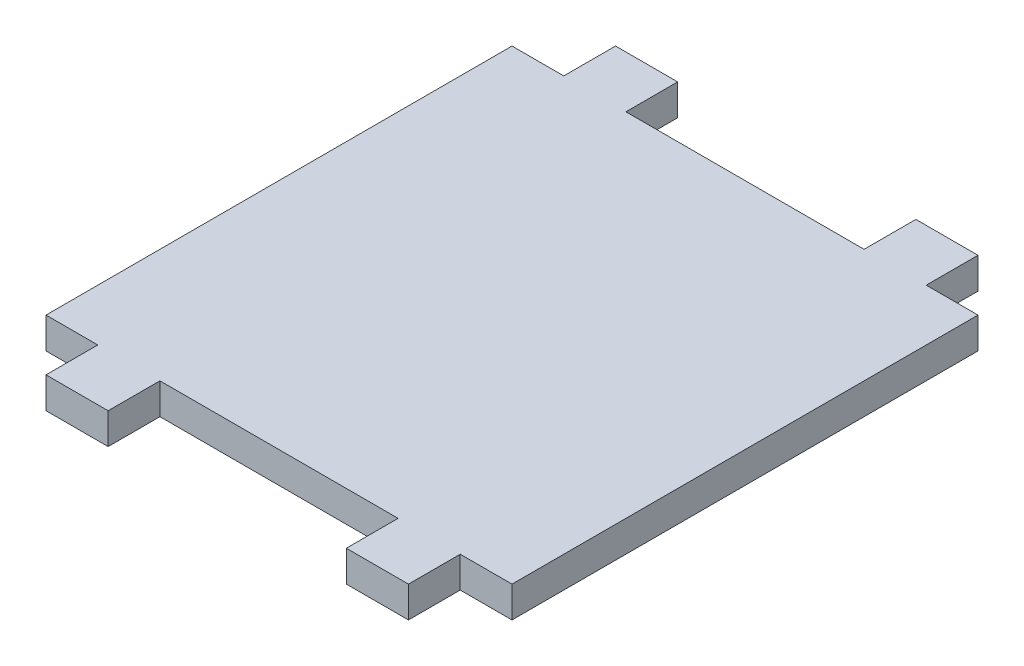
ISO-10303-21;
HEADER;
FILE_DESCRIPTION(('STEP AP214'),'2;1');
FILE_NAME('part.step','',(''),(''),'','','');
FILE_SCHEMA(('AUTOMOTIVE_DESIGN { 1 0 10303 214 1 1 1 1 }'));
ENDSEC;
DATA;
#1=APPLICATION_CONTEXT('core data for automotive mechanical design processes');
#2=APPLICATION_PROTOCOL_DEFINITION('international standard','automotive_design',2000,#1);
#3=PRODUCT_CONTEXT('',#1,'mechanical');
#4=PRODUCT('Part','Part','',(#3));
#5=PRODUCT_RELATED_PRODUCT_CATEGORY('part','',(#4));
#6=PRODUCT_DEFINITION_FORMATION('','',#4);
#7=PRODUCT_DEFINITION_CONTEXT('part definition',#1,'design');
#8=PRODUCT_DEFINITION('design','',#6,#7);
#9=PRODUCT_DEFINITION_SHAPE('','',#8);
#10=(LENGTH_UNIT() NAMED_UNIT(*) SI_UNIT(.MILLI.,.METRE.));
#11=(NAMED_UNIT(*) PLANE_ANGLE_UNIT() SI_UNIT($,.RADIAN.));
#12=(NAMED_UNIT(*) SI_UNIT($,.STERADIAN.) SOLID_ANGLE_UNIT());
#13=UNCERTAINTY_MEASURE_WITH_UNIT(LENGTH_MEASURE(1.E-05),#10,'distance_accuracy_value','');
#14=(GEOMETRIC_REPRESENTATION_CONTEXT(3) GLOBAL_UNCERTAINTY_ASSIGNED_CONTEXT((#13)) GLOBAL_UNIT_ASSIGNED_CONTEXT((#10,
#11,#12)) REPRESENTATION_CONTEXT('',''));
#15=CARTESIAN_POINT('',(0.,0.,0.));
#16=DIRECTION('',(0.,0.,1.));
#17=DIRECTION('',(1.,0.,0.));
#18=AXIS2_PLACEMENT_3D('',#15,#16,#17);
#19=CARTESIAN_POINT('',(22.5,3.,0.));
#20=DIRECTION('',(1.,0.,0.));
#21=DIRECTION('',(0.,0.,-1.));
#22=AXIS2_PLACEMENT_3D('',#19,#20,#21);
#23=PLANE('',#22);
#24=DIRECTION('',(0.,0.,1.));
#25=VECTOR('',#24,1.);
#26=CARTESIAN_POINT('',(22.5,0.,0.));
#27=LINE('',#26,#25);
#28=CARTESIAN_POINT('',(22.5,0.,-22.5));
#29=VERTEX_POINT('',#28);
#30=CARTESIAN_POINT('',(22.5,0.,22.5));
#31=VERTEX_POINT('',#30);
#32=EDGE_CURVE('E204',#29,#31,#27,.T.);
#33=ORIENTED_EDGE('',*,*,#32,.F.);
#34=DIRECTION('',(0.,-1.,0.));
#35=VECTOR('',#34,1.);
#36=CARTESIAN_POINT('',(22.5,3.,-22.5));
#37=LINE('',#36,#35);
#38=CARTESIAN_POINT('',(22.5,3.,-22.5));
#39=VERTEX_POINT('',#38);
#40=EDGE_CURVE('E11',#39,#29,#37,.T.);
#41=ORIENTED_EDGE('',*,*,#40,.F.);
#42=DIRECTION('',(0.,0.,1.));
#43=VECTOR('',#42,1.);
#44=CARTESIAN_POINT('',(22.5,3.,0.));
#45=LINE('',#44,#43);
#46=CARTESIAN_POINT('',(22.5,3.,22.5));
#47=VERTEX_POINT('',#46);
#48=EDGE_CURVE('E298',#39,#47,#45,.T.);
#49=ORIENTED_EDGE('',*,*,#48,.T.);
#50=DIRECTION('',(0.,-1.,0.));
#51=VECTOR('',#50,1.);
#52=CARTESIAN_POINT('',(22.5,3.,22.5));
#53=LINE('',#52,#51);
#54=EDGE_CURVE('E123',#47,#31,#53,.T.);
#55=ORIENTED_EDGE('',*,*,#54,.T.);
#56=EDGE_LOOP('',(#33,#41,#49,#55));
#57=FACE_BOUND('',#56,.T.);
#58=ADVANCED_FACE('F37',(#57),#23,.T.);
#59=CARTESIAN_POINT('',(0.,3.,-22.5));
#60=DIRECTION('',(0.,0.,-1.));
#61=DIRECTION('',(-1.,0.,0.));
#62=AXIS2_PLACEMENT_3D('',#59,#60,#61);
#63=PLANE('',#62);
#64=DIRECTION('',(1.,0.,0.));
#65=VECTOR('',#64,1.);
#66=CARTESIAN_POINT('',(0.,0.,-22.5));
#67=LINE('',#66,#65);
#68=CARTESIAN_POINT('',(17.5,0.,-22.5));
#69=VERTEX_POINT('',#68);
#70=EDGE_CURVE('E207',#69,#29,#67,.T.);
#71=ORIENTED_EDGE('',*,*,#70,.F.);
#72=DIRECTION('',(0.,-1.,0.));
#73=VECTOR('',#72,1.);
#74=CARTESIAN_POINT('',(17.5,3.,-22.5));
#75=LINE('',#74,#73);
#76=CARTESIAN_POINT('',(17.5,3.,-22.5));
#77=VERTEX_POINT('',#76);
#78=EDGE_CURVE('E45',#77,#69,#75,.T.);
#79=ORIENTED_EDGE('',*,*,#78,.F.);
#80=DIRECTION('',(1.,0.,0.));
#81=VECTOR('',#80,1.);
#82=CARTESIAN_POINT('',(0.,3.,-22.5));
#83=LINE('',#82,#81);
#84=EDGE_CURVE('E297',#77,#39,#83,.T.);
#85=ORIENTED_EDGE('',*,*,#84,.T.);
#86=ORIENTED_EDGE('',*,*,#40,.T.);
#87=EDGE_LOOP('',(#71,#79,#85,#86));
#88=FACE_BOUND('',#87,.T.);
#89=ADVANCED_FACE('F296',(#88),#63,.T.);
#90=CARTESIAN_POINT('',(17.5,3.,0.));
#91=DIRECTION('',(-1.,0.,0.));
#92=DIRECTION('',(0.,0.,1.));
#93=AXIS2_PLACEMENT_3D('',#90,#91,#92);
#94=PLANE('',#93);
#95=DIRECTION('',(0.,0.,-1.));
#96=VECTOR('',#95,1.);
#97=CARTESIAN_POINT('',(17.5,0.,0.));
#98=LINE('',#97,#96);
#99=CARTESIAN_POINT('',(17.5,0.,-27.5));
#100=VERTEX_POINT('',#99);
#101=EDGE_CURVE('E210',#69,#100,#98,.T.);
#102=ORIENTED_EDGE('',*,*,#101,.T.);
#103=DIRECTION('',(0.,-1.,0.));
#104=VECTOR('',#103,1.);
#105=CARTESIAN_POINT('',(17.5,3.,-27.5));
#106=LINE('',#105,#104);
#107=CARTESIAN_POINT('',(17.5,3.,-27.5));
#108=VERTEX_POINT('',#107);
#109=EDGE_CURVE('E282',#108,#100,#106,.T.);
#110=ORIENTED_EDGE('',*,*,#109,.F.);
#111=DIRECTION('',(0.,0.,-1.));
#112=VECTOR('',#111,1.);
#113=CARTESIAN_POINT('',(17.5,3.,0.));
#114=LINE('',#113,#112);
#115=EDGE_CURVE('E288',#77,#108,#114,.T.);
#116=ORIENTED_EDGE('',*,*,#115,.F.);
#117=ORIENTED_EDGE('',*,*,#78,.T.);
#118=EDGE_LOOP('',(#102,#110,#116,#117));
#119=FACE_BOUND('',#118,.T.);
#120=ADVANCED_FACE('F286',(#119),#94,.F.);
#121=CARTESIAN_POINT('',(0.,3.,-27.5));
#122=DIRECTION('',(0.,0.,-1.));
#123=DIRECTION('',(-1.,0.,0.));
#124=AXIS2_PLACEMENT_3D('',#121,#122,#123);
#125=PLANE('',#124);
#126=DIRECTION('',(1.,0.,0.));
#127=VECTOR('',#126,1.);
#128=CARTESIAN_POINT('',(0.,0.,-27.5));
#129=LINE('',#128,#127);
#130=CARTESIAN_POINT('',(11.5,0.,-27.5));
#131=VERTEX_POINT('',#130);
#132=EDGE_CURVE('E215',#131,#100,#129,.T.);
#133=ORIENTED_EDGE('',*,*,#132,.F.);
#134=DIRECTION('',(0.,-1.,0.));
#135=VECTOR('',#134,1.);
#136=CARTESIAN_POINT('',(11.5,3.,-27.5));
#137=LINE('',#136,#135);
#138=CARTESIAN_POINT('',(11.5,3.,-27.5));
#139=VERTEX_POINT('',#138);
#140=EDGE_CURVE('E280',#139,#131,#137,.T.);
#141=ORIENTED_EDGE('',*,*,#140,.F.);
#142=DIRECTION('',(1.,0.,0.));
#143=VECTOR('',#142,1.);
#144=CARTESIAN_POINT('',(0.,3.,-27.5));
#145=LINE('',#144,#143);
#146=EDGE_CURVE('E332',#139,#108,#145,.T.);
#147=ORIENTED_EDGE('',*,*,#146,.T.);
#148=ORIENTED_EDGE('',*,*,#109,.T.);
#149=EDGE_LOOP('',(#133,#141,#147,#148));
#150=FACE_BOUND('',#149,.T.);
#151=ADVANCED_FACE('F385',(#150),#125,.T.);
#152=CARTESIAN_POINT('',(11.5,3.,0.));
#153=DIRECTION('',(-1.,0.,0.));
#154=DIRECTION('',(0.,0.,1.));
#155=AXIS2_PLACEMENT_3D('',#152,#153,#154);
#156=PLANE('',#155);
#157=DIRECTION('',(0.,0.,-1.));
#158=VECTOR('',#157,1.);
#159=CARTESIAN_POINT('',(11.5,0.,0.));
#160=LINE('',#159,#158);
#161=CARTESIAN_POINT('',(11.5,0.,-22.5));
#162=VERTEX_POINT('',#161);
#163=EDGE_CURVE('E218',#162,#131,#160,.T.);
#164=ORIENTED_EDGE('',*,*,#163,.F.);
#165=DIRECTION('',(0.,-1.,0.));
#166=VECTOR('',#165,1.);
#167=CARTESIAN_POINT('',(11.5,3.,-22.5));
#168=LINE('',#167,#166);
#169=CARTESIAN_POINT('',(11.5,3.,-22.5));
#170=VERTEX_POINT('',#169);
#171=EDGE_CURVE('E278',#170,#162,#168,.T.);
#172=ORIENTED_EDGE('',*,*,#171,.F.);
#173=DIRECTION('',(0.,0.,-1.));
#174=VECTOR('',#173,1.);
#175=CARTESIAN_POINT('',(11.5,3.,0.));
#176=LINE('',#175,#174);
#177=EDGE_CURVE('E329',#170,#139,#176,.T.);
#178=ORIENTED_EDGE('',*,*,#177,.T.);
#179=ORIENTED_EDGE('',*,*,#140,.T.);
#180=EDGE_LOOP('',(#164,#172,#178,#179));
#181=FACE_BOUND('',#180,.T.);
#182=ADVANCED_FACE('F349',(#181),#156,.T.);
#183=CARTESIAN_POINT('',(-11.5,0.,-22.5));
#184=VERTEX_POINT('',#183);
#185=EDGE_CURVE('E212',#184,#162,#67,.T.);
#186=ORIENTED_EDGE('',*,*,#185,.F.);
#187=DIRECTION('',(0.,-1.,0.));
#188=VECTOR('',#187,1.);
#189=CARTESIAN_POINT('',(-11.5,3.,-22.5));
#190=LINE('',#189,#188);
#191=CARTESIAN_POINT('',(-11.5,3.,-22.5));
#192=VERTEX_POINT('',#191);
#193=EDGE_CURVE('E276',#192,#184,#190,.T.);
#194=ORIENTED_EDGE('',*,*,#193,.F.);
#195=EDGE_CURVE('E328',#192,#170,#83,.T.);
#196=ORIENTED_EDGE('',*,*,#195,.T.);
#197=ORIENTED_EDGE('',*,*,#171,.T.);
#198=EDGE_LOOP('',(#186,#194,#196,#197));
#199=FACE_BOUND('',#198,.T.);
#200=ADVANCED_FACE('F341',(#199),#63,.T.);
#201=CARTESIAN_POINT('',(-11.5,3.,0.));
#202=DIRECTION('',(-1.,0.,0.));
#203=DIRECTION('',(0.,0.,1.));
#204=AXIS2_PLACEMENT_3D('',#201,#202,#203);
#205=PLANE('',#204);
#206=DIRECTION('',(0.,0.,-1.));
#207=VECTOR('',#206,1.);
#208=CARTESIAN_POINT('',(-11.5,0.,0.));
#209=LINE('',#208,#207);
#210=CARTESIAN_POINT('',(-11.5,0.,-27.5));
#211=VERTEX_POINT('',#210);
#212=EDGE_CURVE('E221',#184,#211,#209,.T.);
#213=ORIENTED_EDGE('',*,*,#212,.T.);
#214=DIRECTION('',(0.,-1.,0.));
#215=VECTOR('',#214,1.);
#216=CARTESIAN_POINT('',(-11.5,3.,-27.5));
#217=LINE('',#216,#215);
#218=CARTESIAN_POINT('',(-11.5,3.,-27.5));
#219=VERTEX_POINT('',#218);
#220=EDGE_CURVE('E274',#219,#211,#217,.T.);
#221=ORIENTED_EDGE('',*,*,#220,.F.);
#222=DIRECTION('',(0.,0.,-1.));
#223=VECTOR('',#222,1.);
#224=CARTESIAN_POINT('',(-11.5,3.,0.));
#225=LINE('',#224,#223);
#226=EDGE_CURVE('E326',#192,#219,#225,.T.);
#227=ORIENTED_EDGE('',*,*,#226,.F.);
#228=ORIENTED_EDGE('',*,*,#193,.T.);
#229=EDGE_LOOP('',(#213,#221,#227,#228));
#230=FACE_BOUND('',#229,.T.);
#231=ADVANCED_FACE('F368',(#230),#205,.F.);
#232=CARTESIAN_POINT('',(0.,3.,-27.5));
#233=DIRECTION('',(0.,0.,-1.));
#234=DIRECTION('',(-1.,0.,0.));
#235=AXIS2_PLACEMENT_3D('',#232,#233,#234);
#236=PLANE('',#235);
#237=DIRECTION('',(1.,0.,0.));
#238=VECTOR('',#237,1.);
#239=CARTESIAN_POINT('',(0.,0.,-27.5));
#240=LINE('',#239,#238);
#241=CARTESIAN_POINT('',(-17.5,0.,-27.5));
#242=VERTEX_POINT('',#241);
#243=EDGE_CURVE('E224',#242,#211,#240,.T.);
#244=ORIENTED_EDGE('',*,*,#243,.F.);
#245=DIRECTION('',(0.,-1.,0.));
#246=VECTOR('',#245,1.);
#247=CARTESIAN_POINT('',(-17.5,3.,-27.5));
#248=LINE('',#247,#246);
#249=CARTESIAN_POINT('',(-17.5,3.,-27.5));
#250=VERTEX_POINT('',#249);
#251=EDGE_CURVE('E272',#250,#242,#248,.T.);
#252=ORIENTED_EDGE('',*,*,#251,.F.);
#253=DIRECTION('',(1.,0.,0.));
#254=VECTOR('',#253,1.);
#255=CARTESIAN_POINT('',(0.,3.,-27.5));
#256=LINE('',#255,#254);
#257=EDGE_CURVE('E323',#250,#219,#256,.T.);
#258=ORIENTED_EDGE('',*,*,#257,.T.);
#259=ORIENTED_EDGE('',*,*,#220,.T.);
#260=EDGE_LOOP('',(#244,#252,#258,#259));
#261=FACE_BOUND('',#260,.T.);
#262=ADVANCED_FACE('F366',(#261),#236,.T.);
#263=CARTESIAN_POINT('',(-17.5,3.,0.));
#264=DIRECTION('',(-1.,0.,0.));
#265=DIRECTION('',(0.,0.,1.));
#266=AXIS2_PLACEMENT_3D('',#263,#264,#265);
#267=PLANE('',#266);
#268=DIRECTION('',(0.,0.,-1.));
#269=VECTOR('',#268,1.);
#270=CARTESIAN_POINT('',(-17.5,0.,0.));
#271=LINE('',#270,#269);
#272=CARTESIAN_POINT('',(-17.5,0.,-22.5));
#273=VERTEX_POINT('',#272);
#274=EDGE_CURVE('E227',#273,#242,#271,.T.);
#275=ORIENTED_EDGE('',*,*,#274,.F.);
#276=DIRECTION('',(0.,-1.,0.));
#277=VECTOR('',#276,1.);
#278=CARTESIAN_POINT('',(-17.5,3.,-22.5));
#279=LINE('',#278,#277);
#280=CARTESIAN_POINT('',(-17.5,3.,-22.5));
#281=VERTEX_POINT('',#280);
#282=EDGE_CURVE('E270',#281,#273,#279,.T.);
#283=ORIENTED_EDGE('',*,*,#282,.F.);
#284=DIRECTION('',(0.,0.,-1.));
#285=VECTOR('',#284,1.);
#286=CARTESIAN_POINT('',(-17.5,3.,0.));
#287=LINE('',#286,#285);
#288=EDGE_CURVE('E320',#281,#250,#287,.T.);
#289=ORIENTED_EDGE('',*,*,#288,.T.);
#290=ORIENTED_EDGE('',*,*,#251,.T.);
#291=EDGE_LOOP('',(#275,#283,#289,#290));
#292=FACE_BOUND('',#291,.T.);
#293=ADVANCED_FACE('F363',(#292),#267,.T.);
#294=CARTESIAN_POINT('',(-22.5,0.,-22.5));
#295=VERTEX_POINT('',#294);
#296=EDGE_CURVE('E211',#295,#273,#67,.T.);
#297=ORIENTED_EDGE('',*,*,#296,.F.);
#298=DIRECTION('',(0.,-1.,0.));
#299=VECTOR('',#298,1.);
#300=CARTESIAN_POINT('',(-22.5,3.,-22.5));
#301=LINE('',#300,#299);
#302=CARTESIAN_POINT('',(-22.5,3.,-22.5));
#303=VERTEX_POINT('',#302);
#304=EDGE_CURVE('E268',#303,#295,#301,.T.);
#305=ORIENTED_EDGE('',*,*,#304,.F.);
#306=EDGE_CURVE('E319',#303,#281,#83,.T.);
#307=ORIENTED_EDGE('',*,*,#306,.T.);
#308=ORIENTED_EDGE('',*,*,#282,.T.);
#309=EDGE_LOOP('',(#297,#305,#307,#308));
#310=FACE_BOUND('',#309,.T.);
#311=ADVANCED_FACE('F358',(#310),#63,.T.);
#312=CARTESIAN_POINT('',(-22.5,3.,0.));
#313=DIRECTION('',(1.,0.,0.));
#314=DIRECTION('',(0.,0.,-1.));
#315=AXIS2_PLACEMENT_3D('',#312,#313,#314);
#316=PLANE('',#315);
#317=DIRECTION('',(0.,0.,1.));
#318=VECTOR('',#317,1.);
#319=CARTESIAN_POINT('',(-22.5,0.,0.));
#320=LINE('',#319,#318);
#321=CARTESIAN_POINT('',(-22.5,0.,22.5));
#322=VERTEX_POINT('',#321);
#323=EDGE_CURVE('E230',#295,#322,#320,.T.);
#324=ORIENTED_EDGE('',*,*,#323,.T.);
#325=DIRECTION('',(0.,-1.,0.));
#326=VECTOR('',#325,1.);
#327=CARTESIAN_POINT('',(-22.5,3.,22.5));
#328=LINE('',#327,#326);
#329=CARTESIAN_POINT('',(-22.5,3.,22.5));
#330=VERTEX_POINT('',#329);
#331=EDGE_CURVE('E265',#330,#322,#328,.T.);
#332=ORIENTED_EDGE('',*,*,#331,.F.);
#333=DIRECTION('',(0.,0.,1.));
#334=VECTOR('',#333,1.);
#335=CARTESIAN_POINT('',(-22.5,3.,0.));
#336=LINE('',#335,#334);
#337=EDGE_CURVE('E317',#303,#330,#336,.T.);
#338=ORIENTED_EDGE('',*,*,#337,.F.);
#339=ORIENTED_EDGE('',*,*,#304,.T.);
#340=EDGE_LOOP('',(#324,#332,#338,#339));
#341=FACE_BOUND('',#340,.T.);
#342=ADVANCED_FACE('F389',(#341),#316,.F.);
#343=CARTESIAN_POINT('',(0.,3.,22.5));
#344=DIRECTION('',(0.,0.,-1.));
#345=DIRECTION('',(-1.,0.,0.));
#346=AXIS2_PLACEMENT_3D('',#343,#344,#345);
#347=PLANE('',#346);
#348=DIRECTION('',(1.,0.,0.));
#349=VECTOR('',#348,1.);
#350=CARTESIAN_POINT('',(0.,0.,22.5));
#351=LINE('',#350,#349);
#352=CARTESIAN_POINT('',(-17.5,0.,22.5));
#353=VERTEX_POINT('',#352);
#354=EDGE_CURVE('E232',#322,#353,#351,.T.);
#355=ORIENTED_EDGE('',*,*,#354,.T.);
#356=DIRECTION('',(0.,-1.,0.));
#357=VECTOR('',#356,1.);
#358=CARTESIAN_POINT('',(-17.5,3.,22.5));
#359=LINE('',#358,#357);
#360=CARTESIAN_POINT('',(-17.5,3.,22.5));
#361=VERTEX_POINT('',#360);
#362=EDGE_CURVE('E262',#361,#353,#359,.T.);
#363=ORIENTED_EDGE('',*,*,#362,.F.);
#364=DIRECTION('',(1.,0.,0.));
#365=VECTOR('',#364,1.);
#366=CARTESIAN_POINT('',(0.,3.,22.5));
#367=LINE('',#366,#365);
#368=EDGE_CURVE('E201',#330,#361,#367,.T.);
#369=ORIENTED_EDGE('',*,*,#368,.F.);
#370=ORIENTED_EDGE('',*,*,#331,.T.);
#371=EDGE_LOOP('',(#355,#363,#369,#370));
#372=FACE_BOUND('',#371,.T.);
#373=ADVANCED_FACE('F394',(#372),#347,.F.);
#374=CARTESIAN_POINT('',(-17.5,3.,0.));
#375=DIRECTION('',(1.,0.,0.));
#376=DIRECTION('',(0.,0.,-1.));
#377=AXIS2_PLACEMENT_3D('',#374,#375,#376);
#378=PLANE('',#377);
#379=DIRECTION('',(0.,0.,1.));
#380=VECTOR('',#379,1.);
#381=CARTESIAN_POINT('',(-17.5,0.,0.));
#382=LINE('',#381,#380);
#383=CARTESIAN_POINT('',(-17.5,0.,27.5));
#384=VERTEX_POINT('',#383);
#385=EDGE_CURVE('E234',#353,#384,#382,.T.);
#386=ORIENTED_EDGE('',*,*,#385,.T.);
#387=DIRECTION('',(0.,-1.,0.));
#388=VECTOR('',#387,1.);
#389=CARTESIAN_POINT('',(-17.5,3.,27.5));
#390=LINE('',#389,#388);
#391=CARTESIAN_POINT('',(-17.5,3.,27.5));
#392=VERTEX_POINT('',#391);
#393=EDGE_CURVE('E259',#392,#384,#390,.T.);
#394=ORIENTED_EDGE('',*,*,#393,.F.);
#395=DIRECTION('',(0.,0.,1.));
#396=VECTOR('',#395,1.);
#397=CARTESIAN_POINT('',(-17.5,3.,0.));
#398=LINE('',#397,#396);
#399=EDGE_CURVE('E315',#361,#392,#398,.T.);
#400=ORIENTED_EDGE('',*,*,#399,.F.);
#401=ORIENTED_EDGE('',*,*,#362,.T.);
#402=EDGE_LOOP('',(#386,#394,#400,#401));
#403=FACE_BOUND('',#402,.T.);
#404=ADVANCED_FACE('F481',(#403),#378,.F.);
#405=CARTESIAN_POINT('',(0.,3.,27.5));
#406=DIRECTION('',(0.,0.,-1.));
#407=DIRECTION('',(-1.,0.,0.));
#408=AXIS2_PLACEMENT_3D('',#405,#406,#407);
#409=PLANE('',#408);
#410=DIRECTION('',(1.,0.,0.));
#411=VECTOR('',#410,1.);
#412=CARTESIAN_POINT('',(0.,0.,27.5));
#413=LINE('',#412,#411);
#414=CARTESIAN_POINT('',(-11.5,0.,27.5));
#415=VERTEX_POINT('',#414);
#416=EDGE_CURVE('E238',#384,#415,#413,.T.);
#417=ORIENTED_EDGE('',*,*,#416,.T.);
#418=DIRECTION('',(0.,-1.,0.));
#419=VECTOR('',#418,1.);
#420=CARTESIAN_POINT('',(-11.5,3.,27.5));
#421=LINE('',#420,#419);
#422=CARTESIAN_POINT('',(-11.5,3.,27.5));
#423=VERTEX_POINT('',#422);
#424=EDGE_CURVE('E257',#423,#415,#421,.T.);
#425=ORIENTED_EDGE('',*,*,#424,.F.);
#426=DIRECTION('',(1.,0.,0.));
#427=VECTOR('',#426,1.);
#428=CARTESIAN_POINT('',(0.,3.,27.5));
#429=LINE('',#428,#427);
#430=EDGE_CURVE('E313',#392,#423,#429,.T.);
#431=ORIENTED_EDGE('',*,*,#430,.F.);
#432=ORIENTED_EDGE('',*,*,#393,.T.);
#433=EDGE_LOOP('',(#417,#425,#431,#432));
#434=FACE_BOUND('',#433,.T.);
#435=ADVANCED_FACE('F497',(#434),#409,.F.);
#436=CARTESIAN_POINT('',(-11.5,3.,0.));
#437=DIRECTION('',(1.,0.,0.));
#438=DIRECTION('',(0.,0.,-1.));
#439=AXIS2_PLACEMENT_3D('',#436,#437,#438);
#440=PLANE('',#439);
#441=DIRECTION('',(0.,0.,1.));
#442=VECTOR('',#441,1.);
#443=CARTESIAN_POINT('',(-11.5,0.,0.));
#444=LINE('',#443,#442);
#445=CARTESIAN_POINT('',(-11.5,0.,22.5));
#446=VERTEX_POINT('',#445);
#447=EDGE_CURVE('E241',#446,#415,#444,.T.);
#448=ORIENTED_EDGE('',*,*,#447,.F.);
#449=DIRECTION('',(0.,-1.,0.));
#450=VECTOR('',#449,1.);
#451=CARTESIAN_POINT('',(-11.5,3.,22.5));
#452=LINE('',#451,#450);
#453=CARTESIAN_POINT('',(-11.5,3.,22.5));
#454=VERTEX_POINT('',#453);
#455=EDGE_CURVE('E255',#454,#446,#452,.T.);
#456=ORIENTED_EDGE('',*,*,#455,.F.);
#457=DIRECTION('',(0.,0.,1.));
#458=VECTOR('',#457,1.);
#459=CARTESIAN_POINT('',(-11.5,3.,0.));
#460=LINE('',#459,#458);
#461=EDGE_CURVE('E309',#454,#423,#460,.T.);
#462=ORIENTED_EDGE('',*,*,#461,.T.);
#463=ORIENTED_EDGE('',*,*,#424,.T.);
#464=EDGE_LOOP('',(#448,#456,#462,#463));
#465=FACE_BOUND('',#464,.T.);
#466=ADVANCED_FACE('F506',(#465),#440,.T.);
#467=CARTESIAN_POINT('',(11.5,0.,22.5));
#468=VERTEX_POINT('',#467);
#469=EDGE_CURVE('E236',#446,#468,#351,.T.);
#470=ORIENTED_EDGE('',*,*,#469,.T.);
#471=DIRECTION('',(0.,-1.,0.));
#472=VECTOR('',#471,1.);
#473=CARTESIAN_POINT('',(11.5,3.,22.5));
#474=LINE('',#473,#472);
#475=CARTESIAN_POINT('',(11.5,3.,22.5));
#476=VERTEX_POINT('',#475);
#477=EDGE_CURVE('E252',#476,#468,#474,.T.);
#478=ORIENTED_EDGE('',*,*,#477,.F.);
#479=EDGE_CURVE('E200',#454,#476,#367,.T.);
#480=ORIENTED_EDGE('',*,*,#479,.F.);
#481=ORIENTED_EDGE('',*,*,#455,.T.);
#482=EDGE_LOOP('',(#470,#478,#480,#481));
#483=FACE_BOUND('',#482,.T.);
#484=ADVANCED_FACE('F303',(#483),#347,.F.);
#485=CARTESIAN_POINT('',(11.5,3.,0.));
#486=DIRECTION('',(1.,0.,0.));
#487=DIRECTION('',(0.,0.,-1.));
#488=AXIS2_PLACEMENT_3D('',#485,#486,#487);
#489=PLANE('',#488);
#490=DIRECTION('',(0.,0.,1.));
#491=VECTOR('',#490,1.);
#492=CARTESIAN_POINT('',(11.5,0.,0.));
#493=LINE('',#492,#491);
#494=CARTESIAN_POINT('',(11.5,0.,27.5));
#495=VERTEX_POINT('',#494);
#496=EDGE_CURVE('E244',#468,#495,#493,.T.);
#497=ORIENTED_EDGE('',*,*,#496,.T.);
#498=DIRECTION('',(0.,-1.,0.));
#499=VECTOR('',#498,1.);
#500=CARTESIAN_POINT('',(11.5,3.,27.5));
#501=LINE('',#500,#499);
#502=CARTESIAN_POINT('',(11.5,3.,27.5));
#503=VERTEX_POINT('',#502);
#504=EDGE_CURVE('E195',#503,#495,#501,.T.);
#505=ORIENTED_EDGE('',*,*,#504,.F.);
#506=DIRECTION('',(0.,0.,1.));
#507=VECTOR('',#506,1.);
#508=CARTESIAN_POINT('',(11.5,3.,0.));
#509=LINE('',#508,#507);
#510=EDGE_CURVE('E182',#476,#503,#509,.T.);
#511=ORIENTED_EDGE('',*,*,#510,.F.);
#512=ORIENTED_EDGE('',*,*,#477,.T.);
#513=EDGE_LOOP('',(#497,#505,#511,#512));
#514=FACE_BOUND('',#513,.T.);
#515=ADVANCED_FACE('F308',(#514),#489,.F.);
#516=CARTESIAN_POINT('',(0.,3.,27.5));
#517=DIRECTION('',(0.,0.,-1.));
#518=DIRECTION('',(-1.,0.,0.));
#519=AXIS2_PLACEMENT_3D('',#516,#517,#518);
#520=PLANE('',#519);
#521=DIRECTION('',(1.,0.,0.));
#522=VECTOR('',#521,1.);
#523=CARTESIAN_POINT('',(0.,0.,27.5));
#524=LINE('',#523,#522);
#525=CARTESIAN_POINT('',(17.5,0.,27.5));
#526=VERTEX_POINT('',#525);
#527=EDGE_CURVE('E191',#495,#526,#524,.T.);
#528=ORIENTED_EDGE('',*,*,#527,.T.);
#529=DIRECTION('',(0.,-1.,0.));
#530=VECTOR('',#529,1.);
#531=CARTESIAN_POINT('',(17.5,3.,27.5));
#532=LINE('',#531,#530);
#533=CARTESIAN_POINT('',(17.5,3.,27.5));
#534=VERTEX_POINT('',#533);
#535=EDGE_CURVE('E188',#534,#526,#532,.T.);
#536=ORIENTED_EDGE('',*,*,#535,.F.);
#537=DIRECTION('',(1.,0.,0.));
#538=VECTOR('',#537,1.);
#539=CARTESIAN_POINT('',(0.,3.,27.5));
#540=LINE('',#539,#538);
#541=EDGE_CURVE('E176',#503,#534,#540,.T.);
#542=ORIENTED_EDGE('',*,*,#541,.F.);
#543=ORIENTED_EDGE('',*,*,#504,.T.);
#544=EDGE_LOOP('',(#528,#536,#542,#543));
#545=FACE_BOUND('',#544,.T.);
#546=ADVANCED_FACE('F189',(#545),#520,.F.);
#547=CARTESIAN_POINT('',(17.5,3.,0.));
#548=DIRECTION('',(1.,0.,0.));
#549=DIRECTION('',(0.,0.,-1.));
#550=AXIS2_PLACEMENT_3D('',#547,#548,#549);
#551=PLANE('',#550);
#552=DIRECTION('',(0.,0.,1.));
#553=VECTOR('',#552,1.);
#554=CARTESIAN_POINT('',(17.5,0.,0.));
#555=LINE('',#554,#553);
#556=CARTESIAN_POINT('',(17.5,0.,22.5));
#557=VERTEX_POINT('',#556);
#558=EDGE_CURVE('E247',#557,#526,#555,.T.);
#559=ORIENTED_EDGE('',*,*,#558,.F.);
#560=DIRECTION('',(0.,-1.,0.));
#561=VECTOR('',#560,1.);
#562=CARTESIAN_POINT('',(17.5,3.,22.5));
#563=LINE('',#562,#561);
#564=CARTESIAN_POINT('',(17.5,3.,22.5));
#565=VERTEX_POINT('',#564);
#566=EDGE_CURVE('E116',#565,#557,#563,.T.);
#567=ORIENTED_EDGE('',*,*,#566,.F.);
#568=DIRECTION('',(0.,0.,1.));
#569=VECTOR('',#568,1.);
#570=CARTESIAN_POINT('',(17.5,3.,0.));
#571=LINE('',#570,#569);
#572=EDGE_CURVE('E180',#565,#534,#571,.T.);
#573=ORIENTED_EDGE('',*,*,#572,.T.);
#574=ORIENTED_EDGE('',*,*,#535,.T.);
#575=EDGE_LOOP('',(#559,#567,#573,#574));
#576=FACE_BOUND('',#575,.T.);
#577=ADVANCED_FACE('F197',(#576),#551,.T.);
#578=EDGE_CURVE('E235',#557,#31,#351,.T.);
#579=ORIENTED_EDGE('',*,*,#578,.T.);
#580=ORIENTED_EDGE('',*,*,#54,.F.);
#581=EDGE_CURVE('E53',#565,#47,#367,.T.);
#582=ORIENTED_EDGE('',*,*,#581,.F.);
#583=ORIENTED_EDGE('',*,*,#566,.T.);
#584=EDGE_LOOP('',(#579,#580,#582,#583));
#585=FACE_BOUND('',#584,.T.);
#586=ADVANCED_FACE('F484',(#585),#347,.F.);
#587=CARTESIAN_POINT('',(0.,3.,0.));
#588=DIRECTION('',(0.,1.,0.));
#589=DIRECTION('',(0.,0.,1.));
#590=AXIS2_PLACEMENT_3D('',#587,#588,#589);
#591=PLANE('',#590);
#592=ORIENTED_EDGE('',*,*,#48,.F.);
#593=ORIENTED_EDGE('',*,*,#84,.F.);
#594=ORIENTED_EDGE('',*,*,#115,.T.);
#595=ORIENTED_EDGE('',*,*,#146,.F.);
#596=ORIENTED_EDGE('',*,*,#177,.F.);
#597=ORIENTED_EDGE('',*,*,#195,.F.);
#598=ORIENTED_EDGE('',*,*,#226,.T.);
#599=ORIENTED_EDGE('',*,*,#257,.F.);
#600=ORIENTED_EDGE('',*,*,#288,.F.);
#601=ORIENTED_EDGE('',*,*,#306,.F.);
#602=ORIENTED_EDGE('',*,*,#337,.T.);
#603=ORIENTED_EDGE('',*,*,#368,.T.);
#604=ORIENTED_EDGE('',*,*,#399,.T.);
#605=ORIENTED_EDGE('',*,*,#430,.T.);
#606=ORIENTED_EDGE('',*,*,#461,.F.);
#607=ORIENTED_EDGE('',*,*,#479,.T.);
#608=ORIENTED_EDGE('',*,*,#510,.T.);
#609=ORIENTED_EDGE('',*,*,#541,.T.);
#610=ORIENTED_EDGE('',*,*,#572,.F.);
#611=ORIENTED_EDGE('',*,*,#581,.T.);
#612=EDGE_LOOP('',(#592,#593,#594,#595,#596,#597,#598,#599,#600,#601,#602,#603,#604,#605,#606,
#607,#608,#609,#610,#611));
#613=FACE_BOUND('',#612,.T.);
#614=ADVANCED_FACE('F178',(#613),#591,.T.);
#615=CARTESIAN_POINT('',(0.,0.,0.));
#616=DIRECTION('',(0.,1.,0.));
#617=DIRECTION('',(0.,0.,1.));
#618=AXIS2_PLACEMENT_3D('',#615,#616,#617);
#619=PLANE('',#618);
#620=ORIENTED_EDGE('',*,*,#32,.T.);
#621=ORIENTED_EDGE('',*,*,#578,.F.);
#622=ORIENTED_EDGE('',*,*,#558,.T.);
#623=ORIENTED_EDGE('',*,*,#527,.F.);
#624=ORIENTED_EDGE('',*,*,#496,.F.);
#625=ORIENTED_EDGE('',*,*,#469,.F.);
#626=ORIENTED_EDGE('',*,*,#447,.T.);
#627=ORIENTED_EDGE('',*,*,#416,.F.);
#628=ORIENTED_EDGE('',*,*,#385,.F.);
#629=ORIENTED_EDGE('',*,*,#354,.F.);
#630=ORIENTED_EDGE('',*,*,#323,.F.);
#631=ORIENTED_EDGE('',*,*,#296,.T.);
#632=ORIENTED_EDGE('',*,*,#274,.T.);
#633=ORIENTED_EDGE('',*,*,#243,.T.);
#634=ORIENTED_EDGE('',*,*,#212,.F.);
#635=ORIENTED_EDGE('',*,*,#185,.T.);
#636=ORIENTED_EDGE('',*,*,#163,.T.);
#637=ORIENTED_EDGE('',*,*,#132,.T.);
#638=ORIENTED_EDGE('',*,*,#101,.F.);
#639=ORIENTED_EDGE('',*,*,#70,.T.);
#640=EDGE_LOOP('',(#620,#621,#622,#623,#624,#625,#626,#627,#628,#629,#630,#631,#632,#633,#634,
#635,#636,#637,#638,#639));
#641=FACE_BOUND('',#640,.T.);
#642=ADVANCED_FACE('F294',(#641),#619,.F.);
#643=CLOSED_SHELL('',(#58,#89,#120,#151,#182,#200,#231,#262,#293,#311,#342,#373,#404,#435,#466,
#484,#515,#546,#577,#586,#614,#642));
#644=MANIFOLD_SOLID_BREP('B2',#643);
#645=ADVANCED_BREP_SHAPE_REPRESENTATION('',(#18,#644),#14);
#646=SHAPE_DEFINITION_REPRESENTATION(#9,#645);
ENDSEC;
END-ISO-10303-21;
